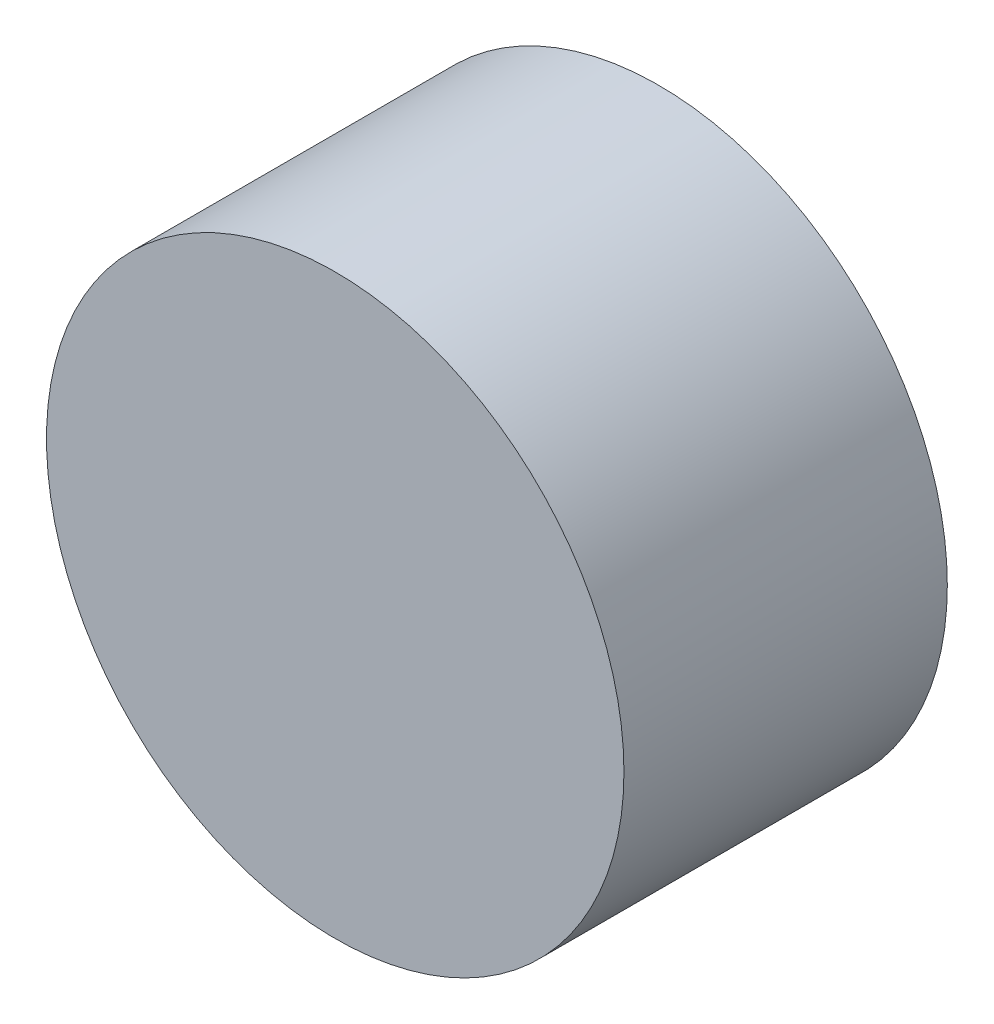
ISO-10303-21;
HEADER;
FILE_DESCRIPTION(('STEP AP214'),'2;1');
FILE_NAME('part.step','',(''),(''),'','','');
FILE_SCHEMA(('AUTOMOTIVE_DESIGN { 1 0 10303 214 1 1 1 1 }'));
ENDSEC;
DATA;
#1=APPLICATION_CONTEXT('core data for automotive mechanical design processes');
#2=APPLICATION_PROTOCOL_DEFINITION('international standard','automotive_design',2000,#1);
#3=PRODUCT_CONTEXT('',#1,'mechanical');
#4=PRODUCT('Part','Part','',(#3));
#5=PRODUCT_RELATED_PRODUCT_CATEGORY('part','',(#4));
#6=PRODUCT_DEFINITION_FORMATION('','',#4);
#7=PRODUCT_DEFINITION_CONTEXT('part definition',#1,'design');
#8=PRODUCT_DEFINITION('design','',#6,#7);
#9=PRODUCT_DEFINITION_SHAPE('','',#8);
#10=(LENGTH_UNIT() NAMED_UNIT(*) SI_UNIT(.MILLI.,.METRE.));
#11=(NAMED_UNIT(*) PLANE_ANGLE_UNIT() SI_UNIT($,.RADIAN.));
#12=(NAMED_UNIT(*) SI_UNIT($,.STERADIAN.) SOLID_ANGLE_UNIT());
#13=UNCERTAINTY_MEASURE_WITH_UNIT(LENGTH_MEASURE(1.E-05),#10,'distance_accuracy_value','');
#14=(GEOMETRIC_REPRESENTATION_CONTEXT(3) GLOBAL_UNCERTAINTY_ASSIGNED_CONTEXT((#13)) GLOBAL_UNIT_ASSIGNED_CONTEXT((#10,
#11,#12)) REPRESENTATION_CONTEXT('',''));
#15=CARTESIAN_POINT('',(0.,0.,0.));
#16=DIRECTION('',(0.,0.,1.));
#17=DIRECTION('',(1.,0.,0.));
#18=AXIS2_PLACEMENT_3D('',#15,#16,#17);
#19=CARTESIAN_POINT('',(0.,0.,28.));
#20=DIRECTION('',(0.,0.,-1.));
#21=DIRECTION('',(-1.,0.,0.));
#22=AXIS2_PLACEMENT_3D('',#19,#20,#21);
#23=CYLINDRICAL_SURFACE('',#22,25.);
#24=CARTESIAN_POINT('',(0.,0.,28.));
#25=DIRECTION('',(0.,0.,1.));
#26=DIRECTION('',(1.,0.,0.));
#27=AXIS2_PLACEMENT_3D('',#24,#25,#26);
#28=CIRCLE('',#27,25.);
#29=CARTESIAN_POINT('',(25.,0.,28.));
#30=VERTEX_POINT('',#29);
#31=EDGE_CURVE('E10',#30,#30,#28,.T.);
#32=ORIENTED_EDGE('',*,*,#31,.F.);
#33=EDGE_LOOP('',(#32));
#34=FACE_BOUND('',#33,.T.);
#35=CARTESIAN_POINT('',(0.,0.,0.));
#36=DIRECTION('',(0.,0.,1.));
#37=DIRECTION('',(1.,0.,0.));
#38=AXIS2_PLACEMENT_3D('',#35,#36,#37);
#39=CIRCLE('',#38,25.);
#40=CARTESIAN_POINT('',(25.,0.,0.));
#41=VERTEX_POINT('',#40);
#42=EDGE_CURVE('E44',#41,#41,#39,.T.);
#43=ORIENTED_EDGE('',*,*,#42,.T.);
#44=EDGE_LOOP('',(#43));
#45=FACE_BOUND('',#44,.T.);
#46=ADVANCED_FACE('F41',(#34,#45),#23,.T.);
#47=CARTESIAN_POINT('',(0.,0.,28.));
#48=DIRECTION('',(0.,0.,1.));
#49=DIRECTION('',(1.,0.,0.));
#50=AXIS2_PLACEMENT_3D('',#47,#48,#49);
#51=PLANE('',#50);
#52=ORIENTED_EDGE('',*,*,#31,.T.);
#53=EDGE_LOOP('',(#52));
#54=FACE_BOUND('',#53,.T.);
#55=ADVANCED_FACE('F58',(#54),#51,.T.);
#56=CARTESIAN_POINT('',(0.,0.,0.));
#57=DIRECTION('',(0.,0.,1.));
#58=DIRECTION('',(1.,0.,0.));
#59=AXIS2_PLACEMENT_3D('',#56,#57,#58);
#60=PLANE('',#59);
#61=ORIENTED_EDGE('',*,*,#42,.F.);
#62=EDGE_LOOP('',(#61));
#63=FACE_BOUND('',#62,.T.);
#64=ADVANCED_FACE('F56',(#63),#60,.F.);
#65=CLOSED_SHELL('',(#46,#55,#64));
#66=MANIFOLD_SOLID_BREP('B2',#65);
#67=ADVANCED_BREP_SHAPE_REPRESENTATION('',(#18,#66),#14);
#68=SHAPE_DEFINITION_REPRESENTATION(#9,#67);
ENDSEC;
END-ISO-10303-21;
